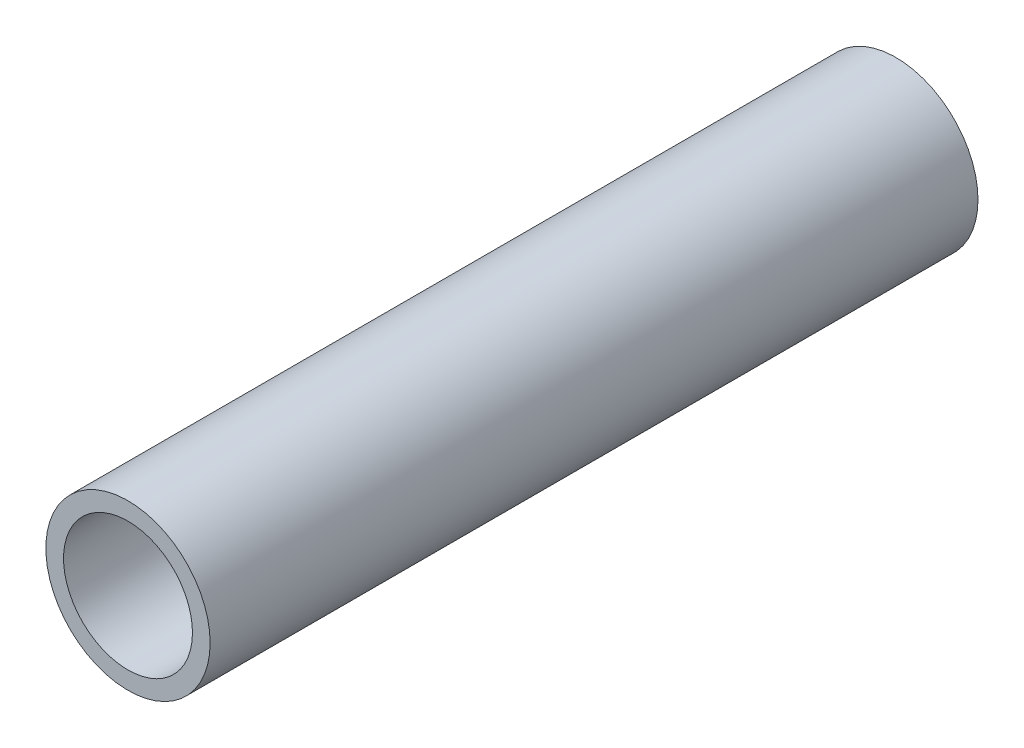
ISO-10303-21;
HEADER;
FILE_DESCRIPTION(('STEP AP214'),'2;1');
FILE_NAME('part.step','',(''),(''),'','','');
FILE_SCHEMA(('AUTOMOTIVE_DESIGN { 1 0 10303 214 1 1 1 1 }'));
ENDSEC;
DATA;
#1=APPLICATION_CONTEXT('core data for automotive mechanical design processes');
#2=APPLICATION_PROTOCOL_DEFINITION('international standard','automotive_design',2000,#1);
#3=PRODUCT_CONTEXT('',#1,'mechanical');
#4=PRODUCT('Part','Part','',(#3));
#5=PRODUCT_RELATED_PRODUCT_CATEGORY('part','',(#4));
#6=PRODUCT_DEFINITION_FORMATION('','',#4);
#7=PRODUCT_DEFINITION_CONTEXT('part definition',#1,'design');
#8=PRODUCT_DEFINITION('design','',#6,#7);
#9=PRODUCT_DEFINITION_SHAPE('','',#8);
#10=(LENGTH_UNIT() NAMED_UNIT(*) SI_UNIT(.MILLI.,.METRE.));
#11=(NAMED_UNIT(*) PLANE_ANGLE_UNIT() SI_UNIT($,.RADIAN.));
#12=(NAMED_UNIT(*) SI_UNIT($,.STERADIAN.) SOLID_ANGLE_UNIT());
#13=UNCERTAINTY_MEASURE_WITH_UNIT(LENGTH_MEASURE(1.E-05),#10,'distance_accuracy_value','');
#14=(GEOMETRIC_REPRESENTATION_CONTEXT(3) GLOBAL_UNCERTAINTY_ASSIGNED_CONTEXT((#13)) GLOBAL_UNIT_ASSIGNED_CONTEXT((#10,
#11,#12)) REPRESENTATION_CONTEXT('',''));
#15=CARTESIAN_POINT('',(0.,0.,0.));
#16=DIRECTION('',(0.,0.,1.));
#17=DIRECTION('',(1.,0.,0.));
#18=AXIS2_PLACEMENT_3D('',#15,#16,#17);
#19=CARTESIAN_POINT('',(0.,0.,762.));
#20=DIRECTION('',(0.,0.,-1.));
#21=DIRECTION('',(-1.,0.,0.));
#22=AXIS2_PLACEMENT_3D('',#19,#20,#21);
#23=CYLINDRICAL_SURFACE('',#22,13.335);
#24=CARTESIAN_POINT('',(0.,0.,-762.));
#25=DIRECTION('',(0.,0.,1.));
#26=DIRECTION('',(1.,0.,0.));
#27=AXIS2_PLACEMENT_3D('',#24,#25,#26);
#28=CIRCLE('',#27,13.335);
#29=CARTESIAN_POINT('',(13.335,0.,-762.));
#30=VERTEX_POINT('',#29);
#31=EDGE_CURVE('E11',#30,#30,#28,.T.);
#32=ORIENTED_EDGE('',*,*,#31,.T.);
#33=EDGE_LOOP('',(#32));
#34=FACE_BOUND('',#33,.T.);
#35=CARTESIAN_POINT('',(0.,0.,-637.35546875));
#36=DIRECTION('',(0.,0.,1.));
#37=DIRECTION('',(1.,0.,0.));
#38=AXIS2_PLACEMENT_3D('',#35,#36,#37);
#39=CIRCLE('',#38,13.335);
#40=CARTESIAN_POINT('',(13.335,0.,-637.35546875));
#41=VERTEX_POINT('',#40);
#42=EDGE_CURVE('E58',#41,#41,#39,.F.);
#43=ORIENTED_EDGE('',*,*,#42,.T.);
#44=EDGE_LOOP('',(#43));
#45=FACE_BOUND('',#44,.T.);
#46=ADVANCED_FACE('F43',(#34,#45),#23,.T.);
#47=CARTESIAN_POINT('',(0.,0.,762.));
#48=DIRECTION('',(0.,0.,-1.));
#49=DIRECTION('',(-1.,0.,0.));
#50=AXIS2_PLACEMENT_3D('',#47,#48,#49);
#51=CYLINDRICAL_SURFACE('',#50,10.4648);
#52=CARTESIAN_POINT('',(0.,0.,-762.));
#53=DIRECTION('',(0.,0.,1.));
#54=DIRECTION('',(1.,0.,0.));
#55=AXIS2_PLACEMENT_3D('',#52,#53,#54);
#56=CIRCLE('',#55,10.4648);
#57=CARTESIAN_POINT('',(10.4648,0.,-762.));
#58=VERTEX_POINT('',#57);
#59=EDGE_CURVE('E51',#58,#58,#56,.T.);
#60=ORIENTED_EDGE('',*,*,#59,.F.);
#61=EDGE_LOOP('',(#60));
#62=FACE_BOUND('',#61,.T.);
#63=CARTESIAN_POINT('',(0.,0.,-637.35546875));
#64=DIRECTION('',(0.,0.,1.));
#65=DIRECTION('',(1.,0.,0.));
#66=AXIS2_PLACEMENT_3D('',#63,#64,#65);
#67=CIRCLE('',#66,10.4648);
#68=CARTESIAN_POINT('',(10.4648,0.,-637.35546875));
#69=VERTEX_POINT('',#68);
#70=EDGE_CURVE('E46',#69,#69,#67,.T.);
#71=ORIENTED_EDGE('',*,*,#70,.T.);
#72=EDGE_LOOP('',(#71));
#73=FACE_BOUND('',#72,.T.);
#74=ADVANCED_FACE('F67',(#62,#73),#51,.F.);
#75=CARTESIAN_POINT('',(0.,0.,-762.));
#76=DIRECTION('',(0.,0.,1.));
#77=DIRECTION('',(1.,0.,0.));
#78=AXIS2_PLACEMENT_3D('',#75,#76,#77);
#79=PLANE('',#78);
#80=ORIENTED_EDGE('',*,*,#59,.T.);
#81=EDGE_LOOP('',(#80));
#82=FACE_BOUND('',#81,.T.);
#83=ORIENTED_EDGE('',*,*,#31,.F.);
#84=EDGE_LOOP('',(#83));
#85=FACE_BOUND('',#84,.T.);
#86=ADVANCED_FACE('F72',(#82,#85),#79,.F.);
#87=CARTESIAN_POINT('',(0.,0.,-637.35546875));
#88=DIRECTION('',(0.,0.,1.));
#89=DIRECTION('',(1.,0.,0.));
#90=AXIS2_PLACEMENT_3D('',#87,#88,#89);
#91=PLANE('',#90);
#92=ORIENTED_EDGE('',*,*,#70,.F.);
#93=EDGE_LOOP('',(#92));
#94=FACE_BOUND('',#93,.T.);
#95=ORIENTED_EDGE('',*,*,#42,.F.);
#96=EDGE_LOOP('',(#95));
#97=FACE_BOUND('',#96,.T.);
#98=ADVANCED_FACE('F69',(#94,#97),#91,.T.);
#99=CLOSED_SHELL('',(#46,#74,#86,#98));
#100=MANIFOLD_SOLID_BREP('B2',#99);
#101=ADVANCED_BREP_SHAPE_REPRESENTATION('',(#18,#100),#14);
#102=SHAPE_DEFINITION_REPRESENTATION(#9,#101);
ENDSEC;
END-ISO-10303-21;
